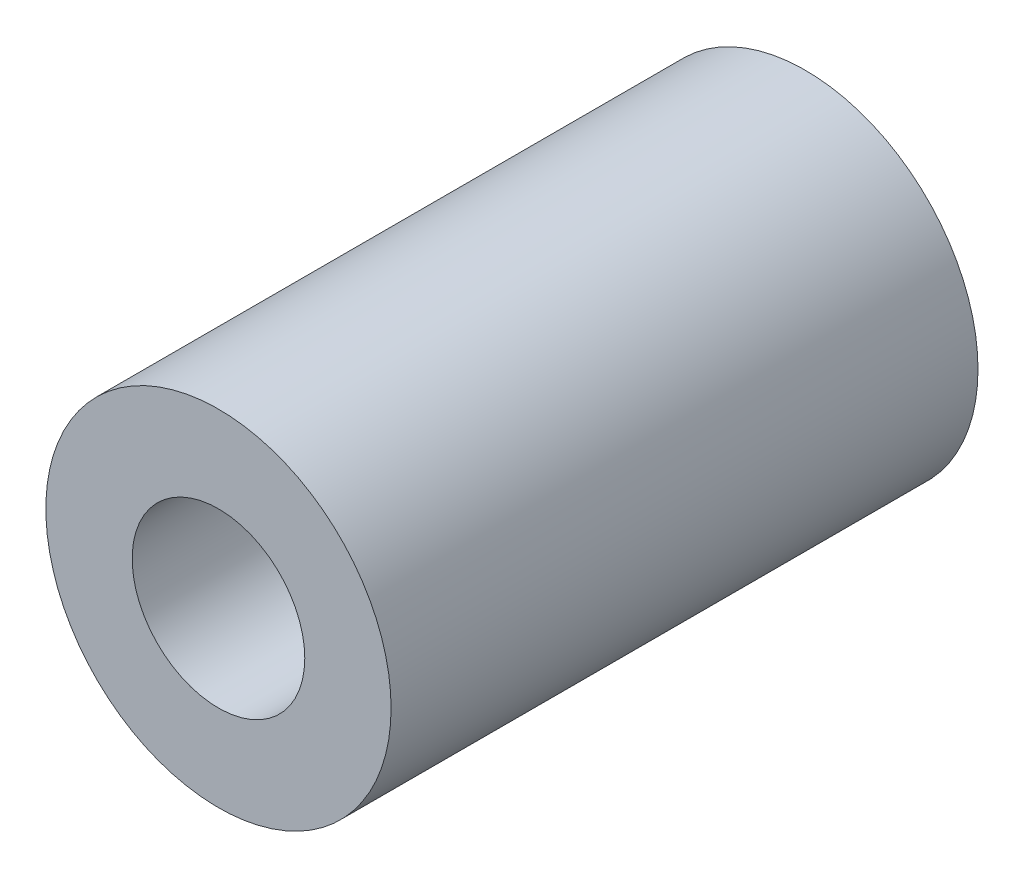
ISO-10303-21;
HEADER;
FILE_DESCRIPTION(('STEP AP214'),'2;1');
FILE_NAME('part.step','',(''),(''),'','','');
FILE_SCHEMA(('AUTOMOTIVE_DESIGN { 1 0 10303 214 1 1 1 1 }'));
ENDSEC;
DATA;
#1=APPLICATION_CONTEXT('core data for automotive mechanical design processes');
#2=APPLICATION_PROTOCOL_DEFINITION('international standard','automotive_design',2000,#1);
#3=PRODUCT_CONTEXT('',#1,'mechanical');
#4=PRODUCT('Part','Part','',(#3));
#5=PRODUCT_RELATED_PRODUCT_CATEGORY('part','',(#4));
#6=PRODUCT_DEFINITION_FORMATION('','',#4);
#7=PRODUCT_DEFINITION_CONTEXT('part definition',#1,'design');
#8=PRODUCT_DEFINITION('design','',#6,#7);
#9=PRODUCT_DEFINITION_SHAPE('','',#8);
#10=(LENGTH_UNIT() NAMED_UNIT(*) SI_UNIT(.MILLI.,.METRE.));
#11=(NAMED_UNIT(*) PLANE_ANGLE_UNIT() SI_UNIT($,.RADIAN.));
#12=(NAMED_UNIT(*) SI_UNIT($,.STERADIAN.) SOLID_ANGLE_UNIT());
#13=UNCERTAINTY_MEASURE_WITH_UNIT(LENGTH_MEASURE(1.E-05),#10,'distance_accuracy_value','');
#14=(GEOMETRIC_REPRESENTATION_CONTEXT(3) GLOBAL_UNCERTAINTY_ASSIGNED_CONTEXT((#13)) GLOBAL_UNIT_ASSIGNED_CONTEXT((#10,
#11,#12)) REPRESENTATION_CONTEXT('',''));
#15=CARTESIAN_POINT('',(0.,0.,0.));
#16=DIRECTION('',(0.,0.,1.));
#17=DIRECTION('',(1.,0.,0.));
#18=AXIS2_PLACEMENT_3D('',#15,#16,#17);
#19=CARTESIAN_POINT('',(0.,0.,17.));
#20=DIRECTION('',(0.,0.,1.));
#21=DIRECTION('',(1.,0.,0.));
#22=AXIS2_PLACEMENT_3D('',#19,#20,#21);
#23=PLANE('',#22);
#24=CARTESIAN_POINT('',(0.,0.,17.));
#25=DIRECTION('',(0.,0.,1.));
#26=DIRECTION('',(1.,0.,0.));
#27=AXIS2_PLACEMENT_3D('',#24,#25,#26);
#28=CIRCLE('',#27,5.);
#29=CARTESIAN_POINT('',(5.,0.,17.));
#30=VERTEX_POINT('',#29);
#31=EDGE_CURVE('E10',#30,#30,#28,.T.);
#32=ORIENTED_EDGE('',*,*,#31,.T.);
#33=EDGE_LOOP('',(#32));
#34=FACE_BOUND('',#33,.T.);
#35=CARTESIAN_POINT('',(0.,0.,17.));
#36=DIRECTION('',(0.,0.,1.));
#37=DIRECTION('',(1.,0.,0.));
#38=AXIS2_PLACEMENT_3D('',#35,#36,#37);
#39=CIRCLE('',#38,2.5);
#40=CARTESIAN_POINT('',(2.5,0.,17.));
#41=VERTEX_POINT('',#40);
#42=EDGE_CURVE('E45',#41,#41,#39,.T.);
#43=ORIENTED_EDGE('',*,*,#42,.F.);
#44=EDGE_LOOP('',(#43));
#45=FACE_BOUND('',#44,.T.);
#46=ADVANCED_FACE('F34',(#34,#45),#23,.T.);
#47=CARTESIAN_POINT('',(0.,0.,0.));
#48=DIRECTION('',(0.,0.,1.));
#49=DIRECTION('',(1.,0.,0.));
#50=AXIS2_PLACEMENT_3D('',#47,#48,#49);
#51=PLANE('',#50);
#52=CARTESIAN_POINT('',(0.,0.,0.));
#53=DIRECTION('',(0.,0.,1.));
#54=DIRECTION('',(1.,0.,0.));
#55=AXIS2_PLACEMENT_3D('',#52,#53,#54);
#56=CIRCLE('',#55,5.);
#57=CARTESIAN_POINT('',(5.,0.,0.));
#58=VERTEX_POINT('',#57);
#59=EDGE_CURVE('E38',#58,#58,#56,.T.);
#60=ORIENTED_EDGE('',*,*,#59,.F.);
#61=EDGE_LOOP('',(#60));
#62=FACE_BOUND('',#61,.T.);
#63=CARTESIAN_POINT('',(0.,0.,0.));
#64=DIRECTION('',(0.,0.,1.));
#65=DIRECTION('',(1.,0.,0.));
#66=AXIS2_PLACEMENT_3D('',#63,#64,#65);
#67=CIRCLE('',#66,2.5);
#68=CARTESIAN_POINT('',(2.5,0.,0.));
#69=VERTEX_POINT('',#68);
#70=EDGE_CURVE('E47',#69,#69,#67,.T.);
#71=ORIENTED_EDGE('',*,*,#70,.T.);
#72=EDGE_LOOP('',(#71));
#73=FACE_BOUND('',#72,.T.);
#74=ADVANCED_FACE('F57',(#62,#73),#51,.F.);
#75=CARTESIAN_POINT('',(0.,0.,17.));
#76=DIRECTION('',(0.,0.,-1.));
#77=DIRECTION('',(-1.,0.,0.));
#78=AXIS2_PLACEMENT_3D('',#75,#76,#77);
#79=CYLINDRICAL_SURFACE('',#78,5.);
#80=ORIENTED_EDGE('',*,*,#31,.F.);
#81=EDGE_LOOP('',(#80));
#82=FACE_BOUND('',#81,.T.);
#83=ORIENTED_EDGE('',*,*,#59,.T.);
#84=EDGE_LOOP('',(#83));
#85=FACE_BOUND('',#84,.T.);
#86=ADVANCED_FACE('F36',(#82,#85),#79,.T.);
#87=CARTESIAN_POINT('',(0.,0.,17.));
#88=DIRECTION('',(0.,0.,-1.));
#89=DIRECTION('',(-1.,0.,0.));
#90=AXIS2_PLACEMENT_3D('',#87,#88,#89);
#91=CYLINDRICAL_SURFACE('',#90,2.5);
#92=ORIENTED_EDGE('',*,*,#42,.T.);
#93=EDGE_LOOP('',(#92));
#94=FACE_BOUND('',#93,.T.);
#95=ORIENTED_EDGE('',*,*,#70,.F.);
#96=EDGE_LOOP('',(#95));
#97=FACE_BOUND('',#96,.T.);
#98=ADVANCED_FACE('F53',(#94,#97),#91,.F.);
#99=CLOSED_SHELL('',(#46,#74,#86,#98));
#100=MANIFOLD_SOLID_BREP('B2',#99);
#101=ADVANCED_BREP_SHAPE_REPRESENTATION('',(#18,#100),#14);
#102=SHAPE_DEFINITION_REPRESENTATION(#9,#101);
ENDSEC;
END-ISO-10303-21;
